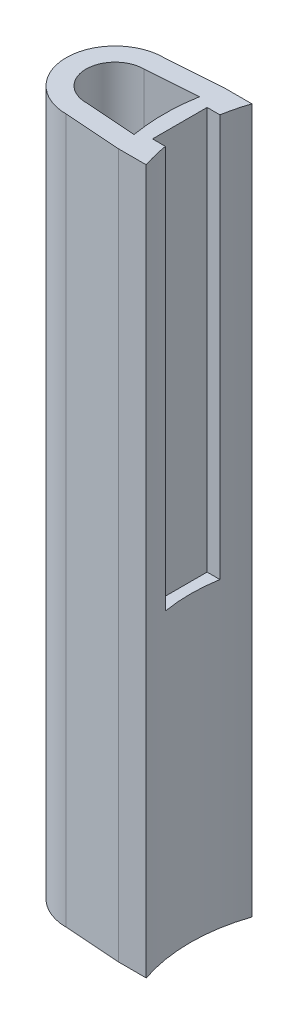
ISO-10303-21;
HEADER;
FILE_DESCRIPTION(('STEP AP214'),'2;1');
FILE_NAME('part.step','',(''),(''),'','','');
FILE_SCHEMA(('AUTOMOTIVE_DESIGN { 1 0 10303 214 1 1 1 1 }'));
ENDSEC;
DATA;
#1=APPLICATION_CONTEXT('core data for automotive mechanical design processes');
#2=APPLICATION_PROTOCOL_DEFINITION('international standard','automotive_design',2000,#1);
#3=PRODUCT_CONTEXT('',#1,'mechanical');
#4=PRODUCT('Part','Part','',(#3));
#5=PRODUCT_RELATED_PRODUCT_CATEGORY('part','',(#4));
#6=PRODUCT_DEFINITION_FORMATION('','',#4);
#7=PRODUCT_DEFINITION_CONTEXT('part definition',#1,'design');
#8=PRODUCT_DEFINITION('design','',#6,#7);
#9=PRODUCT_DEFINITION_SHAPE('','',#8);
#10=(LENGTH_UNIT() NAMED_UNIT(*) SI_UNIT(.MILLI.,.METRE.));
#11=(NAMED_UNIT(*) PLANE_ANGLE_UNIT() SI_UNIT($,.RADIAN.));
#12=(NAMED_UNIT(*) SI_UNIT($,.STERADIAN.) SOLID_ANGLE_UNIT());
#13=UNCERTAINTY_MEASURE_WITH_UNIT(LENGTH_MEASURE(1.E-05),#10,'distance_accuracy_value','');
#14=(GEOMETRIC_REPRESENTATION_CONTEXT(3) GLOBAL_UNCERTAINTY_ASSIGNED_CONTEXT((#13)) GLOBAL_UNIT_ASSIGNED_CONTEXT((#10,
#11,#12)) REPRESENTATION_CONTEXT('',''));
#15=CARTESIAN_POINT('',(0.,0.,0.));
#16=DIRECTION('',(0.,0.,1.));
#17=DIRECTION('',(1.,0.,0.));
#18=AXIS2_PLACEMENT_3D('',#15,#16,#17);
#19=CARTESIAN_POINT('',(0.,40.,0.));
#20=DIRECTION('',(0.,1.,0.));
#21=DIRECTION('',(0.,0.,1.));
#22=AXIS2_PLACEMENT_3D('',#19,#20,#21);
#23=PLANE('',#22);
#24=DIRECTION('',(-1.,0.,0.));
#25=VECTOR('',#24,1.);
#26=CARTESIAN_POINT('',(3.675,40.,-1.55));
#27=LINE('',#26,#25);
#28=CARTESIAN_POINT('',(4.40437095421359,40.,-1.55));
#29=VERTEX_POINT('',#28);
#30=CARTESIAN_POINT('',(3.675,40.,-1.55));
#31=VERTEX_POINT('',#30);
#32=EDGE_CURVE('E159',#29,#31,#27,.T.);
#33=ORIENTED_EDGE('',*,*,#32,.F.);
#34=CARTESIAN_POINT('',(13.625,40.,0.));
#35=DIRECTION('',(0.,-1.,0.));
#36=DIRECTION('',(0.,0.,1.));
#37=AXIS2_PLACEMENT_3D('',#34,#35,#36);
#38=CIRCLE('',#37,9.35);
#39=CARTESIAN_POINT('',(4.76935208468629,40.,-3.));
#40=VERTEX_POINT('',#39);
#41=EDGE_CURVE('E212',#29,#40,#38,.T.);
#42=ORIENTED_EDGE('',*,*,#41,.T.);
#43=DIRECTION('',(-1.,0.,0.));
#44=VECTOR('',#43,1.);
#45=CARTESIAN_POINT('',(3.19799180013749,40.,-3.));
#46=LINE('',#45,#44);
#47=CARTESIAN_POINT('',(3.19799180013749,40.,-3.));
#48=VERTEX_POINT('',#47);
#49=EDGE_CURVE('E216',#40,#48,#46,.T.);
#50=ORIENTED_EDGE('',*,*,#49,.T.);
#51=DIRECTION('',(-0.997534121590686,0.,0.0701831622420841));
#52=VECTOR('',#51,1.);
#53=CARTESIAN_POINT('',(0.,40.,-2.775));
#54=LINE('',#53,#52);
#55=CARTESIAN_POINT('',(0.,40.,-2.775));
#56=VERTEX_POINT('',#55);
#57=EDGE_CURVE('E218',#48,#56,#54,.T.);
#58=ORIENTED_EDGE('',*,*,#57,.T.);
#59=CARTESIAN_POINT('',(0.,40.,0.));
#60=DIRECTION('',(0.,1.,0.));
#61=DIRECTION('',(0.,0.,1.));
#62=AXIS2_PLACEMENT_3D('',#59,#60,#61);
#63=CIRCLE('',#62,2.775);
#64=CARTESIAN_POINT('',(0.,40.,2.775));
#65=VERTEX_POINT('',#64);
#66=EDGE_CURVE('E204',#56,#65,#63,.T.);
#67=ORIENTED_EDGE('',*,*,#66,.T.);
#68=DIRECTION('',(0.997534121590686,0.,0.0701831622420841));
#69=VECTOR('',#68,1.);
#70=CARTESIAN_POINT('',(0.,40.,2.775));
#71=LINE('',#70,#69);
#72=CARTESIAN_POINT('',(3.19799180013749,40.,3.));
#73=VERTEX_POINT('',#72);
#74=EDGE_CURVE('E207',#65,#73,#71,.T.);
#75=ORIENTED_EDGE('',*,*,#74,.T.);
#76=DIRECTION('',(1.,0.,0.));
#77=VECTOR('',#76,1.);
#78=CARTESIAN_POINT('',(3.19799180013749,40.,3.));
#79=LINE('',#78,#77);
#80=CARTESIAN_POINT('',(4.76935208468629,40.,3.));
#81=VERTEX_POINT('',#80);
#82=EDGE_CURVE('E210',#73,#81,#79,.T.);
#83=ORIENTED_EDGE('',*,*,#82,.T.);
#84=CARTESIAN_POINT('',(4.40437095421359,40.,1.55));
#85=VERTEX_POINT('',#84);
#86=EDGE_CURVE('E213',#81,#85,#38,.T.);
#87=ORIENTED_EDGE('',*,*,#86,.T.);
#88=DIRECTION('',(1.,0.,0.));
#89=VECTOR('',#88,1.);
#90=CARTESIAN_POINT('',(3.675,40.,1.55));
#91=LINE('',#90,#89);
#92=CARTESIAN_POINT('',(3.675,40.,1.55));
#93=VERTEX_POINT('',#92);
#94=EDGE_CURVE('E162',#93,#85,#91,.T.);
#95=ORIENTED_EDGE('',*,*,#94,.F.);
#96=DIRECTION('',(0.,0.,1.));
#97=VECTOR('',#96,1.);
#98=CARTESIAN_POINT('',(3.675,40.,-1.55));
#99=LINE('',#98,#97);
#100=EDGE_CURVE('E146',#31,#93,#99,.T.);
#101=ORIENTED_EDGE('',*,*,#100,.F.);
#102=EDGE_LOOP('',(#33,#42,#50,#58,#67,#75,#83,#87,#95,#101));
#103=FACE_BOUND('',#102,.T.);
#104=DIRECTION('',(0.997534121590686,0.,0.0701831622420842));
#105=VECTOR('',#104,1.);
#106=CARTESIAN_POINT('',(0.,40.,1.65));
#107=LINE('',#106,#105);
#108=CARTESIAN_POINT('',(0.,40.,1.65));
#109=VERTEX_POINT('',#108);
#110=CARTESIAN_POINT('',(2.93500853665154,40.,1.85649737773505));
#111=VERTEX_POINT('',#110);
#112=EDGE_CURVE('E177',#109,#111,#107,.T.);
#113=ORIENTED_EDGE('',*,*,#112,.F.);
#114=CARTESIAN_POINT('',(0.,40.,0.));
#115=DIRECTION('',(0.,1.,0.));
#116=DIRECTION('',(0.,0.,1.));
#117=AXIS2_PLACEMENT_3D('',#114,#115,#116);
#118=CIRCLE('',#117,1.65);
#119=CARTESIAN_POINT('',(0.,40.,-1.65));
#120=VERTEX_POINT('',#119);
#121=EDGE_CURVE('E175',#120,#109,#118,.T.);
#122=ORIENTED_EDGE('',*,*,#121,.F.);
#123=DIRECTION('',(-0.997534121590686,0.,0.0701831622420838));
#124=VECTOR('',#123,1.);
#125=CARTESIAN_POINT('',(0.,40.,-1.65));
#126=LINE('',#125,#124);
#127=CARTESIAN_POINT('',(2.93500853665154,40.,-1.85649737773505));
#128=VERTEX_POINT('',#127);
#129=EDGE_CURVE('E182',#128,#120,#126,.T.);
#130=ORIENTED_EDGE('',*,*,#129,.F.);
#131=CARTESIAN_POINT('',(13.625,40.,0.));
#132=DIRECTION('',(0.,-1.,0.));
#133=DIRECTION('',(0.,0.,1.));
#134=AXIS2_PLACEMENT_3D('',#131,#132,#133);
#135=CIRCLE('',#134,10.85);
#136=EDGE_CURVE('E180',#111,#128,#135,.T.);
#137=ORIENTED_EDGE('',*,*,#136,.F.);
#138=EDGE_LOOP('',(#113,#122,#130,#137));
#139=FACE_BOUND('',#138,.T.);
#140=ADVANCED_FACE('F39',(#103,#139),#23,.T.);
#141=CARTESIAN_POINT('',(0.,0.,0.));
#142=DIRECTION('',(0.,1.,0.));
#143=DIRECTION('',(0.,0.,1.));
#144=AXIS2_PLACEMENT_3D('',#141,#142,#143);
#145=PLANE('',#144);
#146=CARTESIAN_POINT('',(0.,0.,0.));
#147=DIRECTION('',(0.,1.,0.));
#148=DIRECTION('',(0.,0.,1.));
#149=AXIS2_PLACEMENT_3D('',#146,#147,#148);
#150=CIRCLE('',#149,2.775);
#151=CARTESIAN_POINT('',(0.,0.,-2.775));
#152=VERTEX_POINT('',#151);
#153=CARTESIAN_POINT('',(0.,0.,2.775));
#154=VERTEX_POINT('',#153);
#155=EDGE_CURVE('E203',#152,#154,#150,.T.);
#156=ORIENTED_EDGE('',*,*,#155,.F.);
#157=DIRECTION('',(-0.997534121590686,0.,0.0701831622420841));
#158=VECTOR('',#157,1.);
#159=CARTESIAN_POINT('',(0.,0.,-2.775));
#160=LINE('',#159,#158);
#161=CARTESIAN_POINT('',(3.19799180013749,0.,-3.));
#162=VERTEX_POINT('',#161);
#163=EDGE_CURVE('E208',#162,#152,#160,.T.);
#164=ORIENTED_EDGE('',*,*,#163,.F.);
#165=DIRECTION('',(-1.,0.,0.));
#166=VECTOR('',#165,1.);
#167=CARTESIAN_POINT('',(3.19799180013749,0.,-3.));
#168=LINE('',#167,#166);
#169=CARTESIAN_POINT('',(4.76935208468629,0.,-3.));
#170=VERTEX_POINT('',#169);
#171=EDGE_CURVE('E229',#170,#162,#168,.T.);
#172=ORIENTED_EDGE('',*,*,#171,.F.);
#173=CARTESIAN_POINT('',(13.625,0.,0.));
#174=DIRECTION('',(0.,-1.,0.));
#175=DIRECTION('',(0.,0.,1.));
#176=AXIS2_PLACEMENT_3D('',#173,#174,#175);
#177=CIRCLE('',#176,9.35);
#178=CARTESIAN_POINT('',(4.76935208468629,0.,3.));
#179=VERTEX_POINT('',#178);
#180=EDGE_CURVE('E227',#179,#170,#177,.T.);
#181=ORIENTED_EDGE('',*,*,#180,.F.);
#182=DIRECTION('',(1.,0.,0.));
#183=VECTOR('',#182,1.);
#184=CARTESIAN_POINT('',(3.19799180013749,0.,3.));
#185=LINE('',#184,#183);
#186=CARTESIAN_POINT('',(3.19799180013749,0.,3.));
#187=VERTEX_POINT('',#186);
#188=EDGE_CURVE('E225',#187,#179,#185,.T.);
#189=ORIENTED_EDGE('',*,*,#188,.F.);
#190=DIRECTION('',(0.997534121590686,0.,0.0701831622420841));
#191=VECTOR('',#190,1.);
#192=CARTESIAN_POINT('',(0.,0.,2.775));
#193=LINE('',#192,#191);
#194=EDGE_CURVE('E223',#154,#187,#193,.T.);
#195=ORIENTED_EDGE('',*,*,#194,.F.);
#196=EDGE_LOOP('',(#156,#164,#172,#181,#189,#195));
#197=FACE_BOUND('',#196,.T.);
#198=CARTESIAN_POINT('',(0.,0.,0.));
#199=DIRECTION('',(0.,1.,0.));
#200=DIRECTION('',(0.,0.,1.));
#201=AXIS2_PLACEMENT_3D('',#198,#199,#200);
#202=CIRCLE('',#201,1.65);
#203=CARTESIAN_POINT('',(0.,0.,-1.65));
#204=VERTEX_POINT('',#203);
#205=CARTESIAN_POINT('',(0.,0.,1.65));
#206=VERTEX_POINT('',#205);
#207=EDGE_CURVE('E171',#204,#206,#202,.T.);
#208=ORIENTED_EDGE('',*,*,#207,.T.);
#209=DIRECTION('',(0.997534121590686,0.,0.0701831622420842));
#210=VECTOR('',#209,1.);
#211=CARTESIAN_POINT('',(0.,0.,1.65));
#212=LINE('',#211,#210);
#213=CARTESIAN_POINT('',(2.93500853665154,0.,1.85649737773505));
#214=VERTEX_POINT('',#213);
#215=EDGE_CURVE('E187',#206,#214,#212,.T.);
#216=ORIENTED_EDGE('',*,*,#215,.T.);
#217=CARTESIAN_POINT('',(13.625,0.,0.));
#218=DIRECTION('',(0.,-1.,0.));
#219=DIRECTION('',(0.,0.,1.));
#220=AXIS2_PLACEMENT_3D('',#217,#218,#219);
#221=CIRCLE('',#220,10.85);
#222=CARTESIAN_POINT('',(2.93500853665154,0.,-1.85649737773505));
#223=VERTEX_POINT('',#222);
#224=EDGE_CURVE('E190',#214,#223,#221,.T.);
#225=ORIENTED_EDGE('',*,*,#224,.T.);
#226=DIRECTION('',(-0.997534121590686,0.,0.0701831622420838));
#227=VECTOR('',#226,1.);
#228=CARTESIAN_POINT('',(0.,0.,-1.65));
#229=LINE('',#228,#227);
#230=EDGE_CURVE('E178',#223,#204,#229,.T.);
#231=ORIENTED_EDGE('',*,*,#230,.T.);
#232=EDGE_LOOP('',(#208,#216,#225,#231));
#233=FACE_BOUND('',#232,.T.);
#234=ADVANCED_FACE('F253',(#197,#233),#145,.F.);
#235=CARTESIAN_POINT('',(0.,40.,0.));
#236=DIRECTION('',(0.,-1.,0.));
#237=DIRECTION('',(0.,0.,-1.));
#238=AXIS2_PLACEMENT_3D('',#235,#236,#237);
#239=CYLINDRICAL_SURFACE('',#238,2.775);
#240=ORIENTED_EDGE('',*,*,#155,.T.);
#241=DIRECTION('',(0.,-1.,0.));
#242=VECTOR('',#241,1.);
#243=CARTESIAN_POINT('',(0.,40.,2.775));
#244=LINE('',#243,#242);
#245=EDGE_CURVE('E11',#65,#154,#244,.T.);
#246=ORIENTED_EDGE('',*,*,#245,.F.);
#247=ORIENTED_EDGE('',*,*,#66,.F.);
#248=DIRECTION('',(0.,-1.,0.));
#249=VECTOR('',#248,1.);
#250=CARTESIAN_POINT('',(0.,40.,-2.775));
#251=LINE('',#250,#249);
#252=EDGE_CURVE('E220',#56,#152,#251,.T.);
#253=ORIENTED_EDGE('',*,*,#252,.T.);
#254=EDGE_LOOP('',(#240,#246,#247,#253));
#255=FACE_BOUND('',#254,.T.);
#256=ADVANCED_FACE('F41',(#255),#239,.T.);
#257=CARTESIAN_POINT('',(0.,40.,2.775));
#258=DIRECTION('',(0.0701831622420841,0.,-0.997534121590686));
#259=DIRECTION('',(-0.997534121590686,0.,-0.0701831622420841));
#260=AXIS2_PLACEMENT_3D('',#257,#258,#259);
#261=PLANE('',#260);
#262=ORIENTED_EDGE('',*,*,#194,.T.);
#263=DIRECTION('',(0.,-1.,0.));
#264=VECTOR('',#263,1.);
#265=CARTESIAN_POINT('',(3.19799180013749,40.,3.));
#266=LINE('',#265,#264);
#267=EDGE_CURVE('E47',#73,#187,#266,.T.);
#268=ORIENTED_EDGE('',*,*,#267,.F.);
#269=ORIENTED_EDGE('',*,*,#74,.F.);
#270=ORIENTED_EDGE('',*,*,#245,.T.);
#271=EDGE_LOOP('',(#262,#268,#269,#270));
#272=FACE_BOUND('',#271,.T.);
#273=ADVANCED_FACE('F276',(#272),#261,.F.);
#274=CARTESIAN_POINT('',(3.19799180013749,40.,3.));
#275=DIRECTION('',(0.,0.,-1.));
#276=DIRECTION('',(-1.,0.,0.));
#277=AXIS2_PLACEMENT_3D('',#274,#275,#276);
#278=PLANE('',#277);
#279=ORIENTED_EDGE('',*,*,#188,.T.);
#280=DIRECTION('',(0.,-1.,0.));
#281=VECTOR('',#280,1.);
#282=CARTESIAN_POINT('',(4.76935208468629,40.,3.));
#283=LINE('',#282,#281);
#284=EDGE_CURVE('E240',#81,#179,#283,.T.);
#285=ORIENTED_EDGE('',*,*,#284,.F.);
#286=ORIENTED_EDGE('',*,*,#82,.F.);
#287=ORIENTED_EDGE('',*,*,#267,.T.);
#288=EDGE_LOOP('',(#279,#285,#286,#287));
#289=FACE_BOUND('',#288,.T.);
#290=ADVANCED_FACE('F247',(#289),#278,.F.);
#291=CARTESIAN_POINT('',(13.625,40.,0.));
#292=DIRECTION('',(0.,-1.,0.));
#293=DIRECTION('',(0.,0.,-1.));
#294=AXIS2_PLACEMENT_3D('',#291,#292,#293);
#295=CYLINDRICAL_SURFACE('',#294,9.35);
#296=ORIENTED_EDGE('',*,*,#41,.F.);
#297=DIRECTION('',(0.,1.,0.));
#298=VECTOR('',#297,1.);
#299=CARTESIAN_POINT('',(4.40437095421359,17.1428571428571,-1.55));
#300=LINE('',#299,#298);
#301=CARTESIAN_POINT('',(4.40437095421359,17.1428571428571,-1.55));
#302=VERTEX_POINT('',#301);
#303=EDGE_CURVE('E172',#302,#29,#300,.T.);
#304=ORIENTED_EDGE('',*,*,#303,.F.);
#305=CARTESIAN_POINT('',(13.625,17.1428571428571,0.));
#306=DIRECTION('',(0.,-1.,0.));
#307=DIRECTION('',(0.,0.,1.));
#308=AXIS2_PLACEMENT_3D('',#305,#306,#307);
#309=CIRCLE('',#308,9.35);
#310=CARTESIAN_POINT('',(4.40437095421359,17.1428571428571,1.55));
#311=VERTEX_POINT('',#310);
#312=EDGE_CURVE('E155',#311,#302,#309,.T.);
#313=ORIENTED_EDGE('',*,*,#312,.F.);
#314=DIRECTION('',(0.,1.,0.));
#315=VECTOR('',#314,1.);
#316=CARTESIAN_POINT('',(4.40437095421359,17.1428571428571,1.55));
#317=LINE('',#316,#315);
#318=EDGE_CURVE('E149',#311,#85,#317,.T.);
#319=ORIENTED_EDGE('',*,*,#318,.T.);
#320=ORIENTED_EDGE('',*,*,#86,.F.);
#321=ORIENTED_EDGE('',*,*,#284,.T.);
#322=ORIENTED_EDGE('',*,*,#180,.T.);
#323=DIRECTION('',(0.,-1.,0.));
#324=VECTOR('',#323,1.);
#325=CARTESIAN_POINT('',(4.76935208468629,40.,-3.));
#326=LINE('',#325,#324);
#327=EDGE_CURVE('E237',#40,#170,#326,.T.);
#328=ORIENTED_EDGE('',*,*,#327,.F.);
#329=EDGE_LOOP('',(#296,#304,#313,#319,#320,#321,#322,#328));
#330=FACE_BOUND('',#329,.T.);
#331=ADVANCED_FACE('F260',(#330),#295,.F.);
#332=CARTESIAN_POINT('',(3.19799180013749,40.,-3.));
#333=DIRECTION('',(0.,0.,1.));
#334=DIRECTION('',(1.,0.,0.));
#335=AXIS2_PLACEMENT_3D('',#332,#333,#334);
#336=PLANE('',#335);
#337=ORIENTED_EDGE('',*,*,#171,.T.);
#338=DIRECTION('',(0.,-1.,0.));
#339=VECTOR('',#338,1.);
#340=CARTESIAN_POINT('',(3.19799180013749,40.,-3.));
#341=LINE('',#340,#339);
#342=EDGE_CURVE('E234',#48,#162,#341,.T.);
#343=ORIENTED_EDGE('',*,*,#342,.F.);
#344=ORIENTED_EDGE('',*,*,#49,.F.);
#345=ORIENTED_EDGE('',*,*,#327,.T.);
#346=EDGE_LOOP('',(#337,#343,#344,#345));
#347=FACE_BOUND('',#346,.T.);
#348=ADVANCED_FACE('F264',(#347),#336,.F.);
#349=CARTESIAN_POINT('',(0.,40.,-2.775));
#350=DIRECTION('',(0.0701831622420841,0.,0.997534121590686));
#351=DIRECTION('',(0.997534121590686,0.,-0.0701831622420841));
#352=AXIS2_PLACEMENT_3D('',#349,#350,#351);
#353=PLANE('',#352);
#354=ORIENTED_EDGE('',*,*,#163,.T.);
#355=ORIENTED_EDGE('',*,*,#252,.F.);
#356=ORIENTED_EDGE('',*,*,#57,.F.);
#357=ORIENTED_EDGE('',*,*,#342,.T.);
#358=EDGE_LOOP('',(#354,#355,#356,#357));
#359=FACE_BOUND('',#358,.T.);
#360=ADVANCED_FACE('F279',(#359),#353,.F.);
#361=CARTESIAN_POINT('',(0.,40.,0.));
#362=DIRECTION('',(0.,-1.,0.));
#363=DIRECTION('',(0.,0.,-1.));
#364=AXIS2_PLACEMENT_3D('',#361,#362,#363);
#365=CYLINDRICAL_SURFACE('',#364,1.65);
#366=ORIENTED_EDGE('',*,*,#207,.F.);
#367=DIRECTION('',(0.,-1.,0.));
#368=VECTOR('',#367,1.);
#369=CARTESIAN_POINT('',(0.,40.,-1.65));
#370=LINE('',#369,#368);
#371=EDGE_CURVE('E184',#120,#204,#370,.T.);
#372=ORIENTED_EDGE('',*,*,#371,.F.);
#373=ORIENTED_EDGE('',*,*,#121,.T.);
#374=DIRECTION('',(0.,-1.,0.));
#375=VECTOR('',#374,1.);
#376=CARTESIAN_POINT('',(0.,40.,1.65));
#377=LINE('',#376,#375);
#378=EDGE_CURVE('E200',#109,#206,#377,.T.);
#379=ORIENTED_EDGE('',*,*,#378,.T.);
#380=EDGE_LOOP('',(#366,#372,#373,#379));
#381=FACE_BOUND('',#380,.T.);
#382=ADVANCED_FACE('F281',(#381),#365,.F.);
#383=CARTESIAN_POINT('',(0.,40.,1.65));
#384=DIRECTION('',(0.0701831622420842,0.,-0.997534121590686));
#385=DIRECTION('',(-0.997534121590686,0.,-0.0701831622420842));
#386=AXIS2_PLACEMENT_3D('',#383,#384,#385);
#387=PLANE('',#386);
#388=ORIENTED_EDGE('',*,*,#215,.F.);
#389=ORIENTED_EDGE('',*,*,#378,.F.);
#390=ORIENTED_EDGE('',*,*,#112,.T.);
#391=DIRECTION('',(0.,-1.,0.));
#392=VECTOR('',#391,1.);
#393=CARTESIAN_POINT('',(2.93500853665154,40.,1.85649737773505));
#394=LINE('',#393,#392);
#395=EDGE_CURVE('E198',#111,#214,#394,.T.);
#396=ORIENTED_EDGE('',*,*,#395,.T.);
#397=EDGE_LOOP('',(#388,#389,#390,#396));
#398=FACE_BOUND('',#397,.T.);
#399=ADVANCED_FACE('F287',(#398),#387,.T.);
#400=CARTESIAN_POINT('',(13.625,40.,0.));
#401=DIRECTION('',(0.,-1.,0.));
#402=DIRECTION('',(0.,0.,-1.));
#403=AXIS2_PLACEMENT_3D('',#400,#401,#402);
#404=CYLINDRICAL_SURFACE('',#403,10.85);
#405=ORIENTED_EDGE('',*,*,#224,.F.);
#406=ORIENTED_EDGE('',*,*,#395,.F.);
#407=ORIENTED_EDGE('',*,*,#136,.T.);
#408=DIRECTION('',(0.,-1.,0.));
#409=VECTOR('',#408,1.);
#410=CARTESIAN_POINT('',(2.93500853665154,40.,-1.85649737773505));
#411=LINE('',#410,#409);
#412=EDGE_CURVE('E62',#128,#223,#411,.T.);
#413=ORIENTED_EDGE('',*,*,#412,.T.);
#414=EDGE_LOOP('',(#405,#406,#407,#413));
#415=FACE_BOUND('',#414,.T.);
#416=ADVANCED_FACE('F302',(#415),#404,.T.);
#417=CARTESIAN_POINT('',(0.,40.,-1.65));
#418=DIRECTION('',(0.0701831622420838,0.,0.997534121590686));
#419=DIRECTION('',(0.997534121590686,0.,-0.0701831622420838));
#420=AXIS2_PLACEMENT_3D('',#417,#418,#419);
#421=PLANE('',#420);
#422=ORIENTED_EDGE('',*,*,#230,.F.);
#423=ORIENTED_EDGE('',*,*,#412,.F.);
#424=ORIENTED_EDGE('',*,*,#129,.T.);
#425=ORIENTED_EDGE('',*,*,#371,.T.);
#426=EDGE_LOOP('',(#422,#423,#424,#425));
#427=FACE_BOUND('',#426,.T.);
#428=ADVANCED_FACE('F306',(#427),#421,.T.);
#429=CARTESIAN_POINT('',(3.675,17.1428571428571,-1.55));
#430=DIRECTION('',(-1.,0.,0.));
#431=DIRECTION('',(0.,0.,1.));
#432=AXIS2_PLACEMENT_3D('',#429,#430,#431);
#433=PLANE('',#432);
#434=ORIENTED_EDGE('',*,*,#100,.T.);
#435=DIRECTION('',(0.,1.,0.));
#436=VECTOR('',#435,1.);
#437=CARTESIAN_POINT('',(3.675,17.1428571428571,1.55));
#438=LINE('',#437,#436);
#439=CARTESIAN_POINT('',(3.675,17.1428571428571,1.55));
#440=VERTEX_POINT('',#439);
#441=EDGE_CURVE('E141',#440,#93,#438,.T.);
#442=ORIENTED_EDGE('',*,*,#441,.F.);
#443=DIRECTION('',(0.,0.,1.));
#444=VECTOR('',#443,1.);
#445=CARTESIAN_POINT('',(3.675,17.1428571428571,-1.55));
#446=LINE('',#445,#444);
#447=CARTESIAN_POINT('',(3.675,17.1428571428571,-1.55));
#448=VERTEX_POINT('',#447);
#449=EDGE_CURVE('E143',#448,#440,#446,.T.);
#450=ORIENTED_EDGE('',*,*,#449,.F.);
#451=DIRECTION('',(0.,1.,0.));
#452=VECTOR('',#451,1.);
#453=CARTESIAN_POINT('',(3.675,17.1428571428571,-1.55));
#454=LINE('',#453,#452);
#455=EDGE_CURVE('E169',#448,#31,#454,.T.);
#456=ORIENTED_EDGE('',*,*,#455,.T.);
#457=EDGE_LOOP('',(#434,#442,#450,#456));
#458=FACE_BOUND('',#457,.T.);
#459=ADVANCED_FACE('F142',(#458),#433,.F.);
#460=CARTESIAN_POINT('',(3.675,17.1428571428571,-1.55));
#461=DIRECTION('',(0.,0.,-1.));
#462=DIRECTION('',(-1.,0.,0.));
#463=AXIS2_PLACEMENT_3D('',#460,#461,#462);
#464=PLANE('',#463);
#465=ORIENTED_EDGE('',*,*,#32,.T.);
#466=ORIENTED_EDGE('',*,*,#455,.F.);
#467=DIRECTION('',(-1.,0.,0.));
#468=VECTOR('',#467,1.);
#469=CARTESIAN_POINT('',(3.675,17.1428571428571,-1.55));
#470=LINE('',#469,#468);
#471=EDGE_CURVE('E150',#302,#448,#470,.T.);
#472=ORIENTED_EDGE('',*,*,#471,.F.);
#473=ORIENTED_EDGE('',*,*,#303,.T.);
#474=EDGE_LOOP('',(#465,#466,#472,#473));
#475=FACE_BOUND('',#474,.T.);
#476=ADVANCED_FACE('F273',(#475),#464,.F.);
#477=CARTESIAN_POINT('',(3.675,17.1428571428571,1.55));
#478=DIRECTION('',(0.,0.,1.));
#479=DIRECTION('',(1.,0.,0.));
#480=AXIS2_PLACEMENT_3D('',#477,#478,#479);
#481=PLANE('',#480);
#482=ORIENTED_EDGE('',*,*,#94,.T.);
#483=ORIENTED_EDGE('',*,*,#318,.F.);
#484=DIRECTION('',(1.,0.,0.));
#485=VECTOR('',#484,1.);
#486=CARTESIAN_POINT('',(3.675,17.1428571428571,1.55));
#487=LINE('',#486,#485);
#488=EDGE_CURVE('E54',#440,#311,#487,.T.);
#489=ORIENTED_EDGE('',*,*,#488,.F.);
#490=ORIENTED_EDGE('',*,*,#441,.T.);
#491=EDGE_LOOP('',(#482,#483,#489,#490));
#492=FACE_BOUND('',#491,.T.);
#493=ADVANCED_FACE('F152',(#492),#481,.F.);
#494=CARTESIAN_POINT('',(13.625,17.1428571428571,0.));
#495=DIRECTION('',(0.,1.,0.));
#496=DIRECTION('',(0.,0.,1.));
#497=AXIS2_PLACEMENT_3D('',#494,#495,#496);
#498=PLANE('',#497);
#499=ORIENTED_EDGE('',*,*,#449,.T.);
#500=ORIENTED_EDGE('',*,*,#488,.T.);
#501=ORIENTED_EDGE('',*,*,#312,.T.);
#502=ORIENTED_EDGE('',*,*,#471,.T.);
#503=EDGE_LOOP('',(#499,#500,#501,#502));
#504=FACE_BOUND('',#503,.T.);
#505=ADVANCED_FACE('F157',(#504),#498,.T.);
#506=CLOSED_SHELL('',(#140,#234,#256,#273,#290,#331,#348,#360,#382,#399,#416,#428,#459,#476,
#493,#505));
#507=MANIFOLD_SOLID_BREP('B2',#506);
#508=ADVANCED_BREP_SHAPE_REPRESENTATION('',(#18,#507),#14);
#509=SHAPE_DEFINITION_REPRESENTATION(#9,#508);
ENDSEC;
END-ISO-10303-21;
